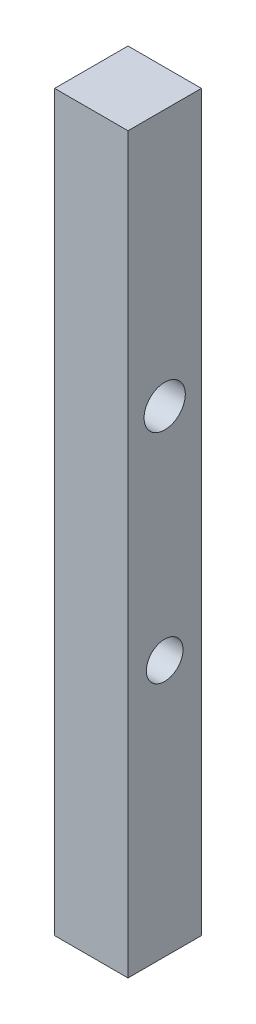
ISO-10303-21;
HEADER;
FILE_DESCRIPTION(('STEP AP214'),'2;1');
FILE_NAME('part.step','',(''),(''),'','','');
FILE_SCHEMA(('AUTOMOTIVE_DESIGN { 1 0 10303 214 1 1 1 1 }'));
ENDSEC;
DATA;
#1=APPLICATION_CONTEXT('core data for automotive mechanical design processes');
#2=APPLICATION_PROTOCOL_DEFINITION('international standard','automotive_design',2000,#1);
#3=PRODUCT_CONTEXT('',#1,'mechanical');
#4=PRODUCT('Part','Part','',(#3));
#5=PRODUCT_RELATED_PRODUCT_CATEGORY('part','',(#4));
#6=PRODUCT_DEFINITION_FORMATION('','',#4);
#7=PRODUCT_DEFINITION_CONTEXT('part definition',#1,'design');
#8=PRODUCT_DEFINITION('design','',#6,#7);
#9=PRODUCT_DEFINITION_SHAPE('','',#8);
#10=(LENGTH_UNIT() NAMED_UNIT(*) SI_UNIT(.MILLI.,.METRE.));
#11=(NAMED_UNIT(*) PLANE_ANGLE_UNIT() SI_UNIT($,.RADIAN.));
#12=(NAMED_UNIT(*) SI_UNIT($,.STERADIAN.) SOLID_ANGLE_UNIT());
#13=UNCERTAINTY_MEASURE_WITH_UNIT(LENGTH_MEASURE(1.E-05),#10,'distance_accuracy_value','');
#14=(GEOMETRIC_REPRESENTATION_CONTEXT(3) GLOBAL_UNCERTAINTY_ASSIGNED_CONTEXT((#13)) GLOBAL_UNIT_ASSIGNED_CONTEXT((#10,
#11,#12)) REPRESENTATION_CONTEXT('',''));
#15=CARTESIAN_POINT('',(0.,0.,0.));
#16=DIRECTION('',(0.,0.,1.));
#17=DIRECTION('',(1.,0.,0.));
#18=AXIS2_PLACEMENT_3D('',#15,#16,#17);
#19=CARTESIAN_POINT('',(0.,254.,0.));
#20=DIRECTION('',(-1.,0.,0.));
#21=DIRECTION('',(0.,0.,1.));
#22=AXIS2_PLACEMENT_3D('',#19,#20,#21);
#23=PLANE('',#22);
#24=CARTESIAN_POINT('',(0.,88.9,-12.7));
#25=DIRECTION('',(1.,0.,0.));
#26=DIRECTION('',(0.,0.,-1.));
#27=AXIS2_PLACEMENT_3D('',#24,#25,#26);
#28=CIRCLE('',#27,6.35);
#29=CARTESIAN_POINT('',(0.,88.9,-19.05));
#30=VERTEX_POINT('',#29);
#31=EDGE_CURVE('E118',#30,#30,#28,.T.);
#32=ORIENTED_EDGE('',*,*,#31,.F.);
#33=EDGE_LOOP('',(#32));
#34=FACE_BOUND('',#33,.T.);
#35=CARTESIAN_POINT('',(0.,165.1,-12.7));
#36=DIRECTION('',(1.,0.,0.));
#37=DIRECTION('',(0.,0.,-1.));
#38=AXIS2_PLACEMENT_3D('',#35,#36,#37);
#39=CIRCLE('',#38,7.1392938692343);
#40=CARTESIAN_POINT('',(0.,165.1,-19.8392938692343));
#41=VERTEX_POINT('',#40);
#42=EDGE_CURVE('E112',#41,#41,#39,.T.);
#43=ORIENTED_EDGE('',*,*,#42,.F.);
#44=EDGE_LOOP('',(#43));
#45=FACE_BOUND('',#44,.T.);
#46=DIRECTION('',(0.,0.,-1.));
#47=VECTOR('',#46,1.);
#48=CARTESIAN_POINT('',(0.,0.,0.));
#49=LINE('',#48,#47);
#50=CARTESIAN_POINT('',(0.,0.,0.));
#51=VERTEX_POINT('',#50);
#52=CARTESIAN_POINT('',(0.,0.,-25.4));
#53=VERTEX_POINT('',#52);
#54=EDGE_CURVE('E98',#51,#53,#49,.T.);
#55=ORIENTED_EDGE('',*,*,#54,.T.);
#56=DIRECTION('',(0.,-1.,0.));
#57=VECTOR('',#56,1.);
#58=CARTESIAN_POINT('',(0.,254.,-25.4));
#59=LINE('',#58,#57);
#60=CARTESIAN_POINT('',(0.,254.,-25.4));
#61=VERTEX_POINT('',#60);
#62=EDGE_CURVE('E11',#61,#53,#59,.T.);
#63=ORIENTED_EDGE('',*,*,#62,.F.);
#64=DIRECTION('',(0.,0.,-1.));
#65=VECTOR('',#64,1.);
#66=CARTESIAN_POINT('',(0.,254.,0.));
#67=LINE('',#66,#65);
#68=CARTESIAN_POINT('',(0.,254.,0.));
#69=VERTEX_POINT('',#68);
#70=EDGE_CURVE('E86',#69,#61,#67,.T.);
#71=ORIENTED_EDGE('',*,*,#70,.F.);
#72=DIRECTION('',(0.,-1.,0.));
#73=VECTOR('',#72,1.);
#74=CARTESIAN_POINT('',(0.,254.,0.));
#75=LINE('',#74,#73);
#76=EDGE_CURVE('E94',#69,#51,#75,.T.);
#77=ORIENTED_EDGE('',*,*,#76,.T.);
#78=EDGE_LOOP('',(#55,#63,#71,#77));
#79=FACE_BOUND('',#78,.T.);
#80=ADVANCED_FACE('F35',(#34,#45,#79),#23,.F.);
#81=CARTESIAN_POINT('',(0.,254.,-25.4));
#82=DIRECTION('',(0.,0.,1.));
#83=DIRECTION('',(1.,0.,0.));
#84=AXIS2_PLACEMENT_3D('',#81,#82,#83);
#85=PLANE('',#84);
#86=DIRECTION('',(-1.,0.,0.));
#87=VECTOR('',#86,1.);
#88=CARTESIAN_POINT('',(0.,0.,-25.4));
#89=LINE('',#88,#87);
#90=CARTESIAN_POINT('',(-25.4,0.,-25.4));
#91=VERTEX_POINT('',#90);
#92=EDGE_CURVE('E90',#53,#91,#89,.T.);
#93=ORIENTED_EDGE('',*,*,#92,.T.);
#94=DIRECTION('',(0.,-1.,0.));
#95=VECTOR('',#94,1.);
#96=CARTESIAN_POINT('',(-25.4,254.,-25.4));
#97=LINE('',#96,#95);
#98=CARTESIAN_POINT('',(-25.4,254.,-25.4));
#99=VERTEX_POINT('',#98);
#100=EDGE_CURVE('E43',#99,#91,#97,.T.);
#101=ORIENTED_EDGE('',*,*,#100,.F.);
#102=DIRECTION('',(-1.,0.,0.));
#103=VECTOR('',#102,1.);
#104=CARTESIAN_POINT('',(0.,254.,-25.4));
#105=LINE('',#104,#103);
#106=EDGE_CURVE('E81',#61,#99,#105,.T.);
#107=ORIENTED_EDGE('',*,*,#106,.F.);
#108=ORIENTED_EDGE('',*,*,#62,.T.);
#109=EDGE_LOOP('',(#93,#101,#107,#108));
#110=FACE_BOUND('',#109,.T.);
#111=ADVANCED_FACE('F89',(#110),#85,.F.);
#112=CARTESIAN_POINT('',(-25.4,254.,0.));
#113=DIRECTION('',(1.,0.,0.));
#114=DIRECTION('',(0.,0.,-1.));
#115=AXIS2_PLACEMENT_3D('',#112,#113,#114);
#116=PLANE('',#115);
#117=CARTESIAN_POINT('',(-25.4,88.9,-12.7));
#118=DIRECTION('',(1.,0.,0.));
#119=DIRECTION('',(0.,0.,-1.));
#120=AXIS2_PLACEMENT_3D('',#117,#118,#119);
#121=CIRCLE('',#120,6.35);
#122=CARTESIAN_POINT('',(-25.4,88.9,-19.05));
#123=VERTEX_POINT('',#122);
#124=EDGE_CURVE('E115',#123,#123,#121,.T.);
#125=ORIENTED_EDGE('',*,*,#124,.T.);
#126=EDGE_LOOP('',(#125));
#127=FACE_BOUND('',#126,.T.);
#128=CARTESIAN_POINT('',(-25.4,165.1,-12.7));
#129=DIRECTION('',(1.,0.,0.));
#130=DIRECTION('',(0.,0.,-1.));
#131=AXIS2_PLACEMENT_3D('',#128,#129,#130);
#132=CIRCLE('',#131,7.1392938692343);
#133=CARTESIAN_POINT('',(-25.4,165.1,-19.8392938692343));
#134=VERTEX_POINT('',#133);
#135=EDGE_CURVE('E101',#134,#134,#132,.T.);
#136=ORIENTED_EDGE('',*,*,#135,.T.);
#137=EDGE_LOOP('',(#136));
#138=FACE_BOUND('',#137,.T.);
#139=DIRECTION('',(0.,0.,1.));
#140=VECTOR('',#139,1.);
#141=CARTESIAN_POINT('',(-25.4,0.,0.));
#142=LINE('',#141,#140);
#143=CARTESIAN_POINT('',(-25.4,0.,0.));
#144=VERTEX_POINT('',#143);
#145=EDGE_CURVE('E68',#91,#144,#142,.T.);
#146=ORIENTED_EDGE('',*,*,#145,.T.);
#147=DIRECTION('',(0.,-1.,0.));
#148=VECTOR('',#147,1.);
#149=CARTESIAN_POINT('',(-25.4,254.,0.));
#150=LINE('',#149,#148);
#151=CARTESIAN_POINT('',(-25.4,254.,0.));
#152=VERTEX_POINT('',#151);
#153=EDGE_CURVE('E91',#152,#144,#150,.T.);
#154=ORIENTED_EDGE('',*,*,#153,.F.);
#155=DIRECTION('',(0.,0.,1.));
#156=VECTOR('',#155,1.);
#157=CARTESIAN_POINT('',(-25.4,254.,0.));
#158=LINE('',#157,#156);
#159=EDGE_CURVE('E84',#99,#152,#158,.T.);
#160=ORIENTED_EDGE('',*,*,#159,.F.);
#161=ORIENTED_EDGE('',*,*,#100,.T.);
#162=EDGE_LOOP('',(#146,#154,#160,#161));
#163=FACE_BOUND('',#162,.T.);
#164=ADVANCED_FACE('F92',(#127,#138,#163),#116,.F.);
#165=CARTESIAN_POINT('',(0.,254.,0.));
#166=DIRECTION('',(0.,0.,-1.));
#167=DIRECTION('',(-1.,0.,0.));
#168=AXIS2_PLACEMENT_3D('',#165,#166,#167);
#169=PLANE('',#168);
#170=DIRECTION('',(1.,0.,0.));
#171=VECTOR('',#170,1.);
#172=CARTESIAN_POINT('',(0.,0.,0.));
#173=LINE('',#172,#171);
#174=EDGE_CURVE('E74',#144,#51,#173,.T.);
#175=ORIENTED_EDGE('',*,*,#174,.T.);
#176=ORIENTED_EDGE('',*,*,#76,.F.);
#177=DIRECTION('',(1.,0.,0.));
#178=VECTOR('',#177,1.);
#179=CARTESIAN_POINT('',(0.,254.,0.));
#180=LINE('',#179,#178);
#181=EDGE_CURVE('E51',#152,#69,#180,.T.);
#182=ORIENTED_EDGE('',*,*,#181,.F.);
#183=ORIENTED_EDGE('',*,*,#153,.T.);
#184=EDGE_LOOP('',(#175,#176,#182,#183));
#185=FACE_BOUND('',#184,.T.);
#186=ADVANCED_FACE('F106',(#185),#169,.F.);
#187=CARTESIAN_POINT('',(0.,254.,0.));
#188=DIRECTION('',(0.,1.,0.));
#189=DIRECTION('',(0.,0.,1.));
#190=AXIS2_PLACEMENT_3D('',#187,#188,#189);
#191=PLANE('',#190);
#192=ORIENTED_EDGE('',*,*,#70,.T.);
#193=ORIENTED_EDGE('',*,*,#106,.T.);
#194=ORIENTED_EDGE('',*,*,#159,.T.);
#195=ORIENTED_EDGE('',*,*,#181,.T.);
#196=EDGE_LOOP('',(#192,#193,#194,#195));
#197=FACE_BOUND('',#196,.T.);
#198=ADVANCED_FACE('F82',(#197),#191,.T.);
#199=CARTESIAN_POINT('',(0.,0.,0.));
#200=DIRECTION('',(0.,1.,0.));
#201=DIRECTION('',(0.,0.,1.));
#202=AXIS2_PLACEMENT_3D('',#199,#200,#201);
#203=PLANE('',#202);
#204=ORIENTED_EDGE('',*,*,#54,.F.);
#205=ORIENTED_EDGE('',*,*,#174,.F.);
#206=ORIENTED_EDGE('',*,*,#145,.F.);
#207=ORIENTED_EDGE('',*,*,#92,.F.);
#208=EDGE_LOOP('',(#204,#205,#206,#207));
#209=FACE_BOUND('',#208,.T.);
#210=ADVANCED_FACE('F109',(#209),#203,.F.);
#211=CARTESIAN_POINT('',(-25.4,165.1,-12.7));
#212=DIRECTION('',(1.,0.,0.));
#213=DIRECTION('',(0.,0.,-1.));
#214=AXIS2_PLACEMENT_3D('',#211,#212,#213);
#215=CYLINDRICAL_SURFACE('',#214,7.1392938692343);
#216=ORIENTED_EDGE('',*,*,#135,.F.);
#217=EDGE_LOOP('',(#216));
#218=FACE_BOUND('',#217,.T.);
#219=ORIENTED_EDGE('',*,*,#42,.T.);
#220=EDGE_LOOP('',(#219));
#221=FACE_BOUND('',#220,.T.);
#222=ADVANCED_FACE('F129',(#218,#221),#215,.F.);
#223=CARTESIAN_POINT('',(-25.4,88.9,-12.7));
#224=DIRECTION('',(1.,0.,0.));
#225=DIRECTION('',(0.,0.,-1.));
#226=AXIS2_PLACEMENT_3D('',#223,#224,#225);
#227=CYLINDRICAL_SURFACE('',#226,6.35);
#228=ORIENTED_EDGE('',*,*,#124,.F.);
#229=EDGE_LOOP('',(#228));
#230=FACE_BOUND('',#229,.T.);
#231=ORIENTED_EDGE('',*,*,#31,.T.);
#232=EDGE_LOOP('',(#231));
#233=FACE_BOUND('',#232,.T.);
#234=ADVANCED_FACE('F126',(#230,#233),#227,.F.);
#235=CLOSED_SHELL('',(#80,#111,#164,#186,#198,#210,#222,#234));
#236=MANIFOLD_SOLID_BREP('B2',#235);
#237=ADVANCED_BREP_SHAPE_REPRESENTATION('',(#18,#236),#14);
#238=SHAPE_DEFINITION_REPRESENTATION(#9,#237);
ENDSEC;
END-ISO-10303-21;
